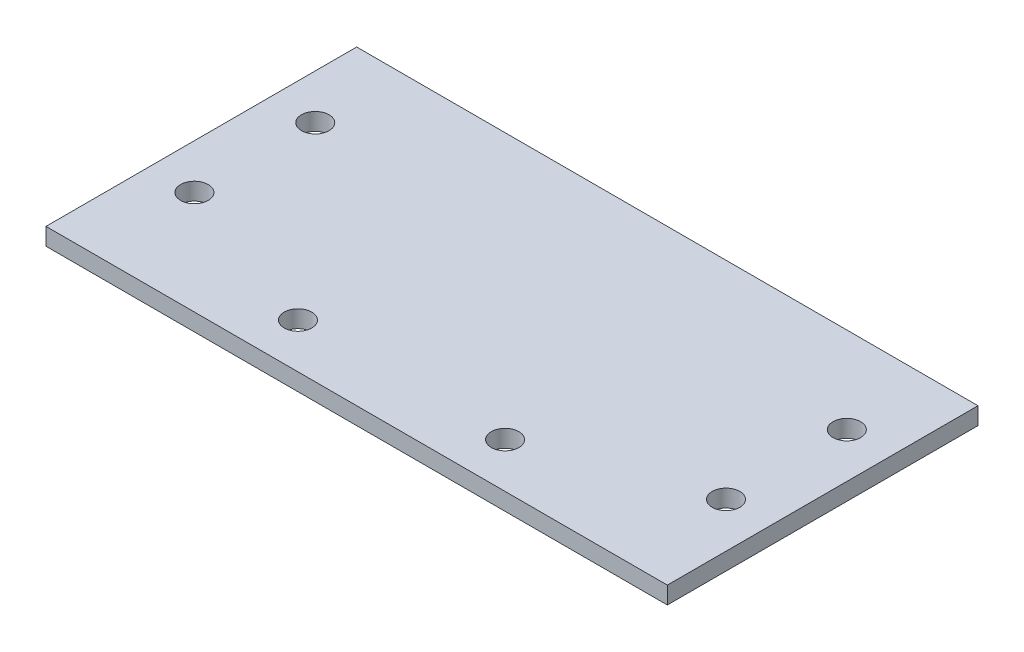
ISO-10303-21;
HEADER;
FILE_DESCRIPTION(('STEP AP214'),'2;1');
FILE_NAME('part.step','',(''),(''),'','','');
FILE_SCHEMA(('AUTOMOTIVE_DESIGN { 1 0 10303 214 1 1 1 1 }'));
ENDSEC;
DATA;
#1=APPLICATION_CONTEXT('core data for automotive mechanical design processes');
#2=APPLICATION_PROTOCOL_DEFINITION('international standard','automotive_design',2000,#1);
#3=PRODUCT_CONTEXT('',#1,'mechanical');
#4=PRODUCT('Part','Part','',(#3));
#5=PRODUCT_RELATED_PRODUCT_CATEGORY('part','',(#4));
#6=PRODUCT_DEFINITION_FORMATION('','',#4);
#7=PRODUCT_DEFINITION_CONTEXT('part definition',#1,'design');
#8=PRODUCT_DEFINITION('design','',#6,#7);
#9=PRODUCT_DEFINITION_SHAPE('','',#8);
#10=(LENGTH_UNIT() NAMED_UNIT(*) SI_UNIT(.MILLI.,.METRE.));
#11=(NAMED_UNIT(*) PLANE_ANGLE_UNIT() SI_UNIT($,.RADIAN.));
#12=(NAMED_UNIT(*) SI_UNIT($,.STERADIAN.) SOLID_ANGLE_UNIT());
#13=UNCERTAINTY_MEASURE_WITH_UNIT(LENGTH_MEASURE(1.E-05),#10,'distance_accuracy_value','');
#14=(GEOMETRIC_REPRESENTATION_CONTEXT(3) GLOBAL_UNCERTAINTY_ASSIGNED_CONTEXT((#13)) GLOBAL_UNIT_ASSIGNED_CONTEXT((#10,
#11,#12)) REPRESENTATION_CONTEXT('',''));
#15=CARTESIAN_POINT('',(0.,0.,0.));
#16=DIRECTION('',(0.,0.,1.));
#17=DIRECTION('',(1.,0.,0.));
#18=AXIS2_PLACEMENT_3D('',#15,#16,#17);
#19=CARTESIAN_POINT('',(-90.,5.,-45.));
#20=DIRECTION('',(1.,0.,0.));
#21=DIRECTION('',(0.,0.,-1.));
#22=AXIS2_PLACEMENT_3D('',#19,#20,#21);
#23=PLANE('',#22);
#24=DIRECTION('',(0.,0.,1.));
#25=VECTOR('',#24,1.);
#26=CARTESIAN_POINT('',(-90.,0.,-45.));
#27=LINE('',#26,#25);
#28=CARTESIAN_POINT('',(-90.,0.,-45.));
#29=VERTEX_POINT('',#28);
#30=CARTESIAN_POINT('',(-90.,0.,45.));
#31=VERTEX_POINT('',#30);
#32=EDGE_CURVE('E111',#29,#31,#27,.T.);
#33=ORIENTED_EDGE('',*,*,#32,.T.);
#34=DIRECTION('',(0.,-1.,0.));
#35=VECTOR('',#34,1.);
#36=CARTESIAN_POINT('',(-90.,5.,45.));
#37=LINE('',#36,#35);
#38=CARTESIAN_POINT('',(-90.,5.,45.));
#39=VERTEX_POINT('',#38);
#40=EDGE_CURVE('E11',#39,#31,#37,.T.);
#41=ORIENTED_EDGE('',*,*,#40,.F.);
#42=DIRECTION('',(0.,0.,1.));
#43=VECTOR('',#42,1.);
#44=CARTESIAN_POINT('',(-90.,5.,-45.));
#45=LINE('',#44,#43);
#46=CARTESIAN_POINT('',(-90.,5.,-45.));
#47=VERTEX_POINT('',#46);
#48=EDGE_CURVE('E95',#47,#39,#45,.T.);
#49=ORIENTED_EDGE('',*,*,#48,.F.);
#50=DIRECTION('',(0.,-1.,0.));
#51=VECTOR('',#50,1.);
#52=CARTESIAN_POINT('',(-90.,5.,-45.));
#53=LINE('',#52,#51);
#54=EDGE_CURVE('E107',#47,#29,#53,.T.);
#55=ORIENTED_EDGE('',*,*,#54,.T.);
#56=EDGE_LOOP('',(#33,#41,#49,#55));
#57=FACE_BOUND('',#56,.T.);
#58=ADVANCED_FACE('F43',(#57),#23,.F.);
#59=CARTESIAN_POINT('',(-90.,5.,45.));
#60=DIRECTION('',(0.,0.,-1.));
#61=DIRECTION('',(-1.,0.,0.));
#62=AXIS2_PLACEMENT_3D('',#59,#60,#61);
#63=PLANE('',#62);
#64=DIRECTION('',(1.,0.,0.));
#65=VECTOR('',#64,1.);
#66=CARTESIAN_POINT('',(-90.,0.,45.));
#67=LINE('',#66,#65);
#68=CARTESIAN_POINT('',(90.,0.,45.));
#69=VERTEX_POINT('',#68);
#70=EDGE_CURVE('E100',#31,#69,#67,.T.);
#71=ORIENTED_EDGE('',*,*,#70,.T.);
#72=DIRECTION('',(0.,-1.,0.));
#73=VECTOR('',#72,1.);
#74=CARTESIAN_POINT('',(90.,5.,45.));
#75=LINE('',#74,#73);
#76=CARTESIAN_POINT('',(90.,5.,45.));
#77=VERTEX_POINT('',#76);
#78=EDGE_CURVE('E52',#77,#69,#75,.T.);
#79=ORIENTED_EDGE('',*,*,#78,.F.);
#80=DIRECTION('',(1.,0.,0.));
#81=VECTOR('',#80,1.);
#82=CARTESIAN_POINT('',(-90.,5.,45.));
#83=LINE('',#82,#81);
#84=EDGE_CURVE('E90',#39,#77,#83,.T.);
#85=ORIENTED_EDGE('',*,*,#84,.F.);
#86=ORIENTED_EDGE('',*,*,#40,.T.);
#87=EDGE_LOOP('',(#71,#79,#85,#86));
#88=FACE_BOUND('',#87,.T.);
#89=ADVANCED_FACE('F99',(#88),#63,.F.);
#90=CARTESIAN_POINT('',(90.,5.,-45.));
#91=DIRECTION('',(-1.,0.,0.));
#92=DIRECTION('',(0.,0.,1.));
#93=AXIS2_PLACEMENT_3D('',#90,#91,#92);
#94=PLANE('',#93);
#95=DIRECTION('',(0.,0.,-1.));
#96=VECTOR('',#95,1.);
#97=CARTESIAN_POINT('',(90.,0.,-45.));
#98=LINE('',#97,#96);
#99=CARTESIAN_POINT('',(90.,0.,-45.));
#100=VERTEX_POINT('',#99);
#101=EDGE_CURVE('E77',#69,#100,#98,.T.);
#102=ORIENTED_EDGE('',*,*,#101,.T.);
#103=DIRECTION('',(0.,-1.,0.));
#104=VECTOR('',#103,1.);
#105=CARTESIAN_POINT('',(90.,5.,-45.));
#106=LINE('',#105,#104);
#107=CARTESIAN_POINT('',(90.,5.,-45.));
#108=VERTEX_POINT('',#107);
#109=EDGE_CURVE('E102',#108,#100,#106,.T.);
#110=ORIENTED_EDGE('',*,*,#109,.F.);
#111=DIRECTION('',(0.,0.,-1.));
#112=VECTOR('',#111,1.);
#113=CARTESIAN_POINT('',(90.,5.,-45.));
#114=LINE('',#113,#112);
#115=EDGE_CURVE('E93',#77,#108,#114,.T.);
#116=ORIENTED_EDGE('',*,*,#115,.F.);
#117=ORIENTED_EDGE('',*,*,#78,.T.);
#118=EDGE_LOOP('',(#102,#110,#116,#117));
#119=FACE_BOUND('',#118,.T.);
#120=ADVANCED_FACE('F103',(#119),#94,.F.);
#121=CARTESIAN_POINT('',(-90.,5.,-45.));
#122=DIRECTION('',(0.,0.,1.));
#123=DIRECTION('',(1.,0.,0.));
#124=AXIS2_PLACEMENT_3D('',#121,#122,#123);
#125=PLANE('',#124);
#126=DIRECTION('',(-1.,0.,0.));
#127=VECTOR('',#126,1.);
#128=CARTESIAN_POINT('',(-90.,0.,-45.));
#129=LINE('',#128,#127);
#130=EDGE_CURVE('E83',#100,#29,#129,.T.);
#131=ORIENTED_EDGE('',*,*,#130,.T.);
#132=ORIENTED_EDGE('',*,*,#54,.F.);
#133=DIRECTION('',(-1.,0.,0.));
#134=VECTOR('',#133,1.);
#135=CARTESIAN_POINT('',(-90.,5.,-45.));
#136=LINE('',#135,#134);
#137=EDGE_CURVE('E60',#108,#47,#136,.T.);
#138=ORIENTED_EDGE('',*,*,#137,.F.);
#139=ORIENTED_EDGE('',*,*,#109,.T.);
#140=EDGE_LOOP('',(#131,#132,#138,#139));
#141=FACE_BOUND('',#140,.T.);
#142=ADVANCED_FACE('F125',(#141),#125,.F.);
#143=CARTESIAN_POINT('',(0.,5.,0.));
#144=DIRECTION('',(0.,1.,0.));
#145=DIRECTION('',(0.,0.,1.));
#146=AXIS2_PLACEMENT_3D('',#143,#144,#145);
#147=PLANE('',#146);
#148=CARTESIAN_POINT('',(-77.,5.,-20.));
#149=DIRECTION('',(0.,1.,0.));
#150=DIRECTION('',(0.,0.,1.));
#151=AXIS2_PLACEMENT_3D('',#148,#149,#150);
#152=CIRCLE('',#151,4.);
#153=CARTESIAN_POINT('',(-77.,5.,-16.));
#154=VERTEX_POINT('',#153);
#155=EDGE_CURVE('E175',#154,#154,#152,.T.);
#156=ORIENTED_EDGE('',*,*,#155,.F.);
#157=EDGE_LOOP('',(#156));
#158=FACE_BOUND('',#157,.T.);
#159=CARTESIAN_POINT('',(-77.,5.,15.));
#160=DIRECTION('',(0.,1.,0.));
#161=DIRECTION('',(0.,0.,1.));
#162=AXIS2_PLACEMENT_3D('',#159,#160,#161);
#163=CIRCLE('',#162,4.);
#164=CARTESIAN_POINT('',(-77.,5.,19.));
#165=VERTEX_POINT('',#164);
#166=EDGE_CURVE('E167',#165,#165,#163,.T.);
#167=ORIENTED_EDGE('',*,*,#166,.F.);
#168=EDGE_LOOP('',(#167));
#169=FACE_BOUND('',#168,.T.);
#170=CARTESIAN_POINT('',(-30.,5.,32.));
#171=DIRECTION('',(0.,1.,0.));
#172=DIRECTION('',(0.,0.,1.));
#173=AXIS2_PLACEMENT_3D('',#170,#171,#172);
#174=CIRCLE('',#173,4.);
#175=CARTESIAN_POINT('',(-30.,5.,36.));
#176=VERTEX_POINT('',#175);
#177=EDGE_CURVE('E159',#176,#176,#174,.T.);
#178=ORIENTED_EDGE('',*,*,#177,.F.);
#179=EDGE_LOOP('',(#178));
#180=FACE_BOUND('',#179,.T.);
#181=CARTESIAN_POINT('',(30.,5.,32.));
#182=DIRECTION('',(0.,1.,0.));
#183=DIRECTION('',(0.,0.,1.));
#184=AXIS2_PLACEMENT_3D('',#181,#182,#183);
#185=CIRCLE('',#184,4.);
#186=CARTESIAN_POINT('',(30.,5.,36.));
#187=VERTEX_POINT('',#186);
#188=EDGE_CURVE('E151',#187,#187,#185,.T.);
#189=ORIENTED_EDGE('',*,*,#188,.F.);
#190=EDGE_LOOP('',(#189));
#191=FACE_BOUND('',#190,.T.);
#192=CARTESIAN_POINT('',(77.,5.,15.));
#193=DIRECTION('',(0.,1.,0.));
#194=DIRECTION('',(0.,0.,1.));
#195=AXIS2_PLACEMENT_3D('',#192,#193,#194);
#196=CIRCLE('',#195,4.);
#197=CARTESIAN_POINT('',(77.,5.,19.));
#198=VERTEX_POINT('',#197);
#199=EDGE_CURVE('E143',#198,#198,#196,.T.);
#200=ORIENTED_EDGE('',*,*,#199,.F.);
#201=EDGE_LOOP('',(#200));
#202=FACE_BOUND('',#201,.T.);
#203=CARTESIAN_POINT('',(77.,5.,-20.));
#204=DIRECTION('',(0.,1.,0.));
#205=DIRECTION('',(0.,0.,1.));
#206=AXIS2_PLACEMENT_3D('',#203,#204,#205);
#207=CIRCLE('',#206,4.);
#208=CARTESIAN_POINT('',(77.,5.,-16.));
#209=VERTEX_POINT('',#208);
#210=EDGE_CURVE('E135',#209,#209,#207,.T.);
#211=ORIENTED_EDGE('',*,*,#210,.F.);
#212=EDGE_LOOP('',(#211));
#213=FACE_BOUND('',#212,.T.);
#214=ORIENTED_EDGE('',*,*,#48,.T.);
#215=ORIENTED_EDGE('',*,*,#84,.T.);
#216=ORIENTED_EDGE('',*,*,#115,.T.);
#217=ORIENTED_EDGE('',*,*,#137,.T.);
#218=EDGE_LOOP('',(#214,#215,#216,#217));
#219=FACE_BOUND('',#218,.T.);
#220=ADVANCED_FACE('F91',(#158,#169,#180,#191,#202,#213,#219),#147,.T.);
#221=CARTESIAN_POINT('',(0.,0.,0.));
#222=DIRECTION('',(0.,1.,0.));
#223=DIRECTION('',(0.,0.,1.));
#224=AXIS2_PLACEMENT_3D('',#221,#222,#223);
#225=PLANE('',#224);
#226=CARTESIAN_POINT('',(-77.,0.,-20.));
#227=DIRECTION('',(0.,1.,0.));
#228=DIRECTION('',(0.,0.,1.));
#229=AXIS2_PLACEMENT_3D('',#226,#227,#228);
#230=CIRCLE('',#229,4.);
#231=CARTESIAN_POINT('',(-77.,0.,-16.));
#232=VERTEX_POINT('',#231);
#233=EDGE_CURVE('E171',#232,#232,#230,.T.);
#234=ORIENTED_EDGE('',*,*,#233,.T.);
#235=EDGE_LOOP('',(#234));
#236=FACE_BOUND('',#235,.T.);
#237=CARTESIAN_POINT('',(-77.,0.,15.));
#238=DIRECTION('',(0.,1.,0.));
#239=DIRECTION('',(0.,0.,1.));
#240=AXIS2_PLACEMENT_3D('',#237,#238,#239);
#241=CIRCLE('',#240,4.);
#242=CARTESIAN_POINT('',(-77.,0.,19.));
#243=VERTEX_POINT('',#242);
#244=EDGE_CURVE('E163',#243,#243,#241,.T.);
#245=ORIENTED_EDGE('',*,*,#244,.T.);
#246=EDGE_LOOP('',(#245));
#247=FACE_BOUND('',#246,.T.);
#248=CARTESIAN_POINT('',(-30.,0.,32.));
#249=DIRECTION('',(0.,1.,0.));
#250=DIRECTION('',(0.,0.,1.));
#251=AXIS2_PLACEMENT_3D('',#248,#249,#250);
#252=CIRCLE('',#251,4.);
#253=CARTESIAN_POINT('',(-30.,0.,36.));
#254=VERTEX_POINT('',#253);
#255=EDGE_CURVE('E155',#254,#254,#252,.T.);
#256=ORIENTED_EDGE('',*,*,#255,.T.);
#257=EDGE_LOOP('',(#256));
#258=FACE_BOUND('',#257,.T.);
#259=CARTESIAN_POINT('',(30.,0.,32.));
#260=DIRECTION('',(0.,1.,0.));
#261=DIRECTION('',(0.,0.,1.));
#262=AXIS2_PLACEMENT_3D('',#259,#260,#261);
#263=CIRCLE('',#262,4.);
#264=CARTESIAN_POINT('',(30.,0.,36.));
#265=VERTEX_POINT('',#264);
#266=EDGE_CURVE('E147',#265,#265,#263,.T.);
#267=ORIENTED_EDGE('',*,*,#266,.T.);
#268=EDGE_LOOP('',(#267));
#269=FACE_BOUND('',#268,.T.);
#270=CARTESIAN_POINT('',(77.,0.,15.));
#271=DIRECTION('',(0.,1.,0.));
#272=DIRECTION('',(0.,0.,1.));
#273=AXIS2_PLACEMENT_3D('',#270,#271,#272);
#274=CIRCLE('',#273,4.);
#275=CARTESIAN_POINT('',(77.,0.,19.));
#276=VERTEX_POINT('',#275);
#277=EDGE_CURVE('E139',#276,#276,#274,.T.);
#278=ORIENTED_EDGE('',*,*,#277,.T.);
#279=EDGE_LOOP('',(#278));
#280=FACE_BOUND('',#279,.T.);
#281=CARTESIAN_POINT('',(77.,0.,-20.));
#282=DIRECTION('',(0.,1.,0.));
#283=DIRECTION('',(0.,0.,1.));
#284=AXIS2_PLACEMENT_3D('',#281,#282,#283);
#285=CIRCLE('',#284,4.);
#286=CARTESIAN_POINT('',(77.,0.,-16.));
#287=VERTEX_POINT('',#286);
#288=EDGE_CURVE('E115',#287,#287,#285,.T.);
#289=ORIENTED_EDGE('',*,*,#288,.T.);
#290=EDGE_LOOP('',(#289));
#291=FACE_BOUND('',#290,.T.);
#292=ORIENTED_EDGE('',*,*,#32,.F.);
#293=ORIENTED_EDGE('',*,*,#130,.F.);
#294=ORIENTED_EDGE('',*,*,#101,.F.);
#295=ORIENTED_EDGE('',*,*,#70,.F.);
#296=EDGE_LOOP('',(#292,#293,#294,#295));
#297=FACE_BOUND('',#296,.T.);
#298=ADVANCED_FACE('F128',(#236,#247,#258,#269,#280,#291,#297),#225,.F.);
#299=CARTESIAN_POINT('',(77.,5.,-20.));
#300=DIRECTION('',(0.,1.,0.));
#301=DIRECTION('',(0.,0.,1.));
#302=AXIS2_PLACEMENT_3D('',#299,#300,#301);
#303=CYLINDRICAL_SURFACE('',#302,4.);
#304=ORIENTED_EDGE('',*,*,#288,.F.);
#305=EDGE_LOOP('',(#304));
#306=FACE_BOUND('',#305,.T.);
#307=ORIENTED_EDGE('',*,*,#210,.T.);
#308=EDGE_LOOP('',(#307));
#309=FACE_BOUND('',#308,.T.);
#310=ADVANCED_FACE('F195',(#306,#309),#303,.F.);
#311=CARTESIAN_POINT('',(77.,5.,15.));
#312=DIRECTION('',(0.,1.,0.));
#313=DIRECTION('',(0.,0.,1.));
#314=AXIS2_PLACEMENT_3D('',#311,#312,#313);
#315=CYLINDRICAL_SURFACE('',#314,4.);
#316=ORIENTED_EDGE('',*,*,#277,.F.);
#317=EDGE_LOOP('',(#316));
#318=FACE_BOUND('',#317,.T.);
#319=ORIENTED_EDGE('',*,*,#199,.T.);
#320=EDGE_LOOP('',(#319));
#321=FACE_BOUND('',#320,.T.);
#322=ADVANCED_FACE('F197',(#318,#321),#315,.F.);
#323=CARTESIAN_POINT('',(30.,5.,32.));
#324=DIRECTION('',(0.,1.,0.));
#325=DIRECTION('',(0.,0.,1.));
#326=AXIS2_PLACEMENT_3D('',#323,#324,#325);
#327=CYLINDRICAL_SURFACE('',#326,4.);
#328=ORIENTED_EDGE('',*,*,#266,.F.);
#329=EDGE_LOOP('',(#328));
#330=FACE_BOUND('',#329,.T.);
#331=ORIENTED_EDGE('',*,*,#188,.T.);
#332=EDGE_LOOP('',(#331));
#333=FACE_BOUND('',#332,.T.);
#334=ADVANCED_FACE('F204',(#330,#333),#327,.F.);
#335=CARTESIAN_POINT('',(-30.,5.,32.));
#336=DIRECTION('',(0.,1.,0.));
#337=DIRECTION('',(0.,0.,1.));
#338=AXIS2_PLACEMENT_3D('',#335,#336,#337);
#339=CYLINDRICAL_SURFACE('',#338,4.);
#340=ORIENTED_EDGE('',*,*,#255,.F.);
#341=EDGE_LOOP('',(#340));
#342=FACE_BOUND('',#341,.T.);
#343=ORIENTED_EDGE('',*,*,#177,.T.);
#344=EDGE_LOOP('',(#343));
#345=FACE_BOUND('',#344,.T.);
#346=ADVANCED_FACE('F254',(#342,#345),#339,.F.);
#347=CARTESIAN_POINT('',(-77.,5.,15.));
#348=DIRECTION('',(0.,1.,0.));
#349=DIRECTION('',(0.,0.,1.));
#350=AXIS2_PLACEMENT_3D('',#347,#348,#349);
#351=CYLINDRICAL_SURFACE('',#350,4.);
#352=ORIENTED_EDGE('',*,*,#244,.F.);
#353=EDGE_LOOP('',(#352));
#354=FACE_BOUND('',#353,.T.);
#355=ORIENTED_EDGE('',*,*,#166,.T.);
#356=EDGE_LOOP('',(#355));
#357=FACE_BOUND('',#356,.T.);
#358=ADVANCED_FACE('F265',(#354,#357),#351,.F.);
#359=CARTESIAN_POINT('',(-77.,5.,-20.));
#360=DIRECTION('',(0.,1.,0.));
#361=DIRECTION('',(0.,0.,1.));
#362=AXIS2_PLACEMENT_3D('',#359,#360,#361);
#363=CYLINDRICAL_SURFACE('',#362,4.);
#364=ORIENTED_EDGE('',*,*,#233,.F.);
#365=EDGE_LOOP('',(#364));
#366=FACE_BOUND('',#365,.T.);
#367=ORIENTED_EDGE('',*,*,#155,.T.);
#368=EDGE_LOOP('',(#367));
#369=FACE_BOUND('',#368,.T.);
#370=ADVANCED_FACE('F180',(#366,#369),#363,.F.);
#371=CLOSED_SHELL('',(#58,#89,#120,#142,#220,#298,#310,#322,#334,#346,#358,#370));
#372=MANIFOLD_SOLID_BREP('B2',#371);
#373=ADVANCED_BREP_SHAPE_REPRESENTATION('',(#18,#372),#14);
#374=SHAPE_DEFINITION_REPRESENTATION(#9,#373);
ENDSEC;
END-ISO-10303-21;
